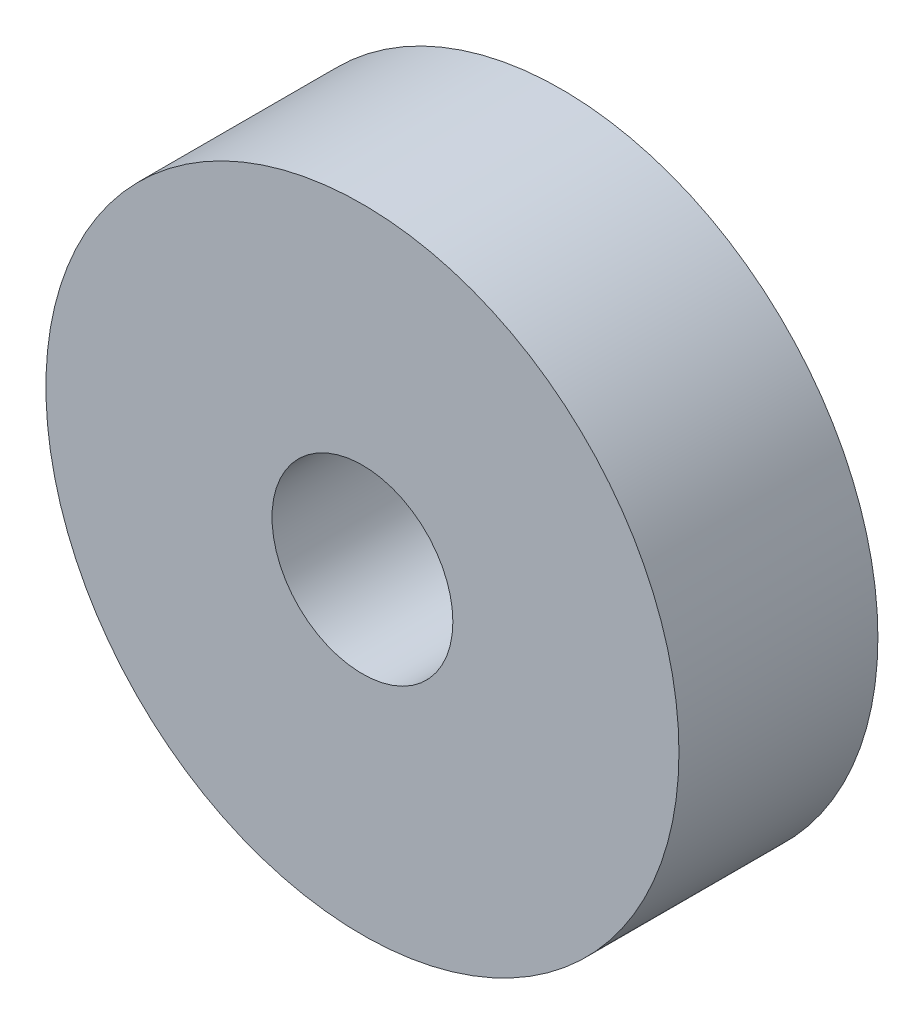
ISO-10303-21;
HEADER;
FILE_DESCRIPTION(('STEP AP214'),'2;1');
FILE_NAME('part.step','',(''),(''),'','','');
FILE_SCHEMA(('AUTOMOTIVE_DESIGN { 1 0 10303 214 1 1 1 1 }'));
ENDSEC;
DATA;
#1=APPLICATION_CONTEXT('core data for automotive mechanical design processes');
#2=APPLICATION_PROTOCOL_DEFINITION('international standard','automotive_design',2000,#1);
#3=PRODUCT_CONTEXT('',#1,'mechanical');
#4=PRODUCT('Part','Part','',(#3));
#5=PRODUCT_RELATED_PRODUCT_CATEGORY('part','',(#4));
#6=PRODUCT_DEFINITION_FORMATION('','',#4);
#7=PRODUCT_DEFINITION_CONTEXT('part definition',#1,'design');
#8=PRODUCT_DEFINITION('design','',#6,#7);
#9=PRODUCT_DEFINITION_SHAPE('','',#8);
#10=(LENGTH_UNIT() NAMED_UNIT(*) SI_UNIT(.MILLI.,.METRE.));
#11=(NAMED_UNIT(*) PLANE_ANGLE_UNIT() SI_UNIT($,.RADIAN.));
#12=(NAMED_UNIT(*) SI_UNIT($,.STERADIAN.) SOLID_ANGLE_UNIT());
#13=UNCERTAINTY_MEASURE_WITH_UNIT(LENGTH_MEASURE(1.E-05),#10,'distance_accuracy_value','');
#14=(GEOMETRIC_REPRESENTATION_CONTEXT(3) GLOBAL_UNCERTAINTY_ASSIGNED_CONTEXT((#13)) GLOBAL_UNIT_ASSIGNED_CONTEXT((#10,
#11,#12)) REPRESENTATION_CONTEXT('',''));
#15=CARTESIAN_POINT('',(0.,0.,0.));
#16=DIRECTION('',(0.,0.,1.));
#17=DIRECTION('',(1.,0.,0.));
#18=AXIS2_PLACEMENT_3D('',#15,#16,#17);
#19=CARTESIAN_POINT('',(0.,0.,11.));
#20=DIRECTION('',(0.,0.,1.));
#21=DIRECTION('',(1.,0.,0.));
#22=AXIS2_PLACEMENT_3D('',#19,#20,#21);
#23=PLANE('',#22);
#24=CARTESIAN_POINT('',(0.,0.,11.));
#25=DIRECTION('',(0.,0.,1.));
#26=DIRECTION('',(1.,0.,0.));
#27=AXIS2_PLACEMENT_3D('',#24,#25,#26);
#28=CIRCLE('',#27,17.5);
#29=CARTESIAN_POINT('',(17.5,0.,11.));
#30=VERTEX_POINT('',#29);
#31=EDGE_CURVE('E10',#30,#30,#28,.T.);
#32=ORIENTED_EDGE('',*,*,#31,.T.);
#33=EDGE_LOOP('',(#32));
#34=FACE_BOUND('',#33,.T.);
#35=CARTESIAN_POINT('',(0.,0.,11.));
#36=DIRECTION('',(0.,0.,1.));
#37=DIRECTION('',(1.,0.,0.));
#38=AXIS2_PLACEMENT_3D('',#35,#36,#37);
#39=CIRCLE('',#38,5.);
#40=CARTESIAN_POINT('',(5.,0.,11.));
#41=VERTEX_POINT('',#40);
#42=EDGE_CURVE('E42',#41,#41,#39,.T.);
#43=ORIENTED_EDGE('',*,*,#42,.F.);
#44=EDGE_LOOP('',(#43));
#45=FACE_BOUND('',#44,.T.);
#46=ADVANCED_FACE('F31',(#34,#45),#23,.T.);
#47=CARTESIAN_POINT('',(0.,0.,0.));
#48=DIRECTION('',(0.,0.,1.));
#49=DIRECTION('',(1.,0.,0.));
#50=AXIS2_PLACEMENT_3D('',#47,#48,#49);
#51=PLANE('',#50);
#52=CARTESIAN_POINT('',(0.,0.,0.));
#53=DIRECTION('',(0.,0.,1.));
#54=DIRECTION('',(1.,0.,0.));
#55=AXIS2_PLACEMENT_3D('',#52,#53,#54);
#56=CIRCLE('',#55,17.5);
#57=CARTESIAN_POINT('',(17.5,0.,0.));
#58=VERTEX_POINT('',#57);
#59=EDGE_CURVE('E35',#58,#58,#56,.T.);
#60=ORIENTED_EDGE('',*,*,#59,.F.);
#61=EDGE_LOOP('',(#60));
#62=FACE_BOUND('',#61,.T.);
#63=CARTESIAN_POINT('',(0.,0.,0.));
#64=DIRECTION('',(0.,0.,1.));
#65=DIRECTION('',(1.,0.,0.));
#66=AXIS2_PLACEMENT_3D('',#63,#64,#65);
#67=CIRCLE('',#66,5.);
#68=CARTESIAN_POINT('',(5.,0.,0.));
#69=VERTEX_POINT('',#68);
#70=EDGE_CURVE('E44',#69,#69,#67,.T.);
#71=ORIENTED_EDGE('',*,*,#70,.T.);
#72=EDGE_LOOP('',(#71));
#73=FACE_BOUND('',#72,.T.);
#74=ADVANCED_FACE('F54',(#62,#73),#51,.F.);
#75=CARTESIAN_POINT('',(0.,0.,11.));
#76=DIRECTION('',(0.,0.,-1.));
#77=DIRECTION('',(-1.,0.,0.));
#78=AXIS2_PLACEMENT_3D('',#75,#76,#77);
#79=CYLINDRICAL_SURFACE('',#78,17.5);
#80=ORIENTED_EDGE('',*,*,#31,.F.);
#81=EDGE_LOOP('',(#80));
#82=FACE_BOUND('',#81,.T.);
#83=ORIENTED_EDGE('',*,*,#59,.T.);
#84=EDGE_LOOP('',(#83));
#85=FACE_BOUND('',#84,.T.);
#86=ADVANCED_FACE('F33',(#82,#85),#79,.T.);
#87=CARTESIAN_POINT('',(0.,0.,11.));
#88=DIRECTION('',(0.,0.,-1.));
#89=DIRECTION('',(-1.,0.,0.));
#90=AXIS2_PLACEMENT_3D('',#87,#88,#89);
#91=CYLINDRICAL_SURFACE('',#90,5.);
#92=ORIENTED_EDGE('',*,*,#42,.T.);
#93=EDGE_LOOP('',(#92));
#94=FACE_BOUND('',#93,.T.);
#95=ORIENTED_EDGE('',*,*,#70,.F.);
#96=EDGE_LOOP('',(#95));
#97=FACE_BOUND('',#96,.T.);
#98=ADVANCED_FACE('F50',(#94,#97),#91,.F.);
#99=CLOSED_SHELL('',(#46,#74,#86,#98));
#100=MANIFOLD_SOLID_BREP('B2',#99);
#101=ADVANCED_BREP_SHAPE_REPRESENTATION('',(#18,#100),#14);
#102=SHAPE_DEFINITION_REPRESENTATION(#9,#101);
ENDSEC;
END-ISO-10303-21;
